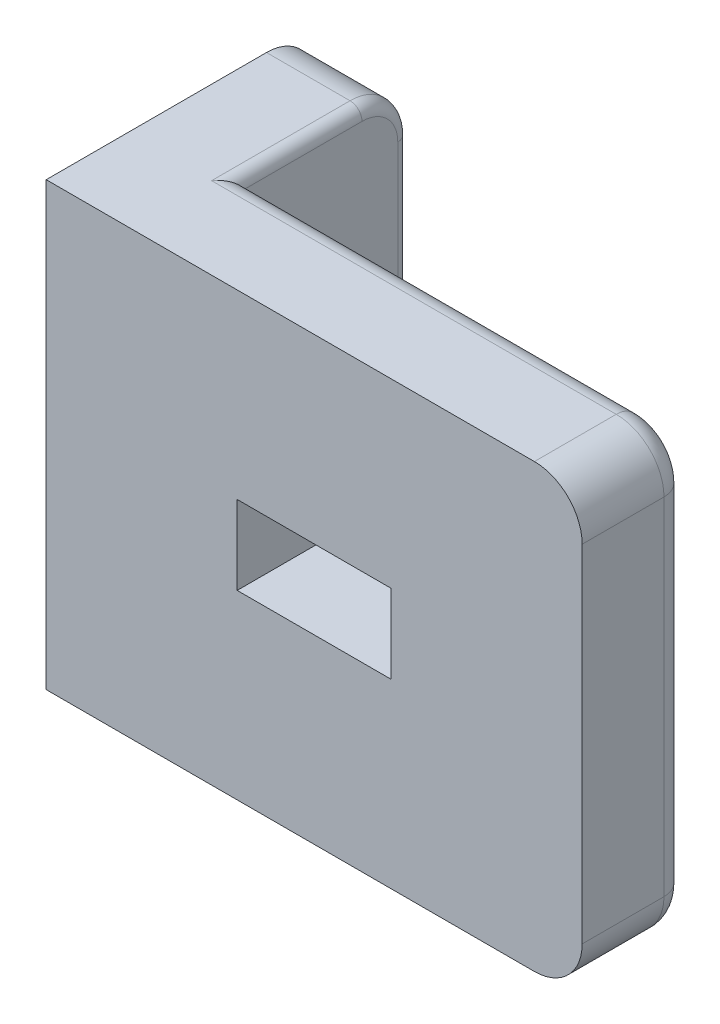
ISO-10303-21;
HEADER;
FILE_DESCRIPTION(('STEP AP214'),'2;1');
FILE_NAME('part.step','',(''),(''),'','','');
FILE_SCHEMA(('AUTOMOTIVE_DESIGN { 1 0 10303 214 1 1 1 1 }'));
ENDSEC;
DATA;
#1=APPLICATION_CONTEXT('core data for automotive mechanical design processes');
#2=APPLICATION_PROTOCOL_DEFINITION('international standard','automotive_design',2000,#1);
#3=PRODUCT_CONTEXT('',#1,'mechanical');
#4=PRODUCT('Part','Part','',(#3));
#5=PRODUCT_RELATED_PRODUCT_CATEGORY('part','',(#4));
#6=PRODUCT_DEFINITION_FORMATION('','',#4);
#7=PRODUCT_DEFINITION_CONTEXT('part definition',#1,'design');
#8=PRODUCT_DEFINITION('design','',#6,#7);
#9=PRODUCT_DEFINITION_SHAPE('','',#8);
#10=(LENGTH_UNIT() NAMED_UNIT(*) SI_UNIT(.MILLI.,.METRE.));
#11=(NAMED_UNIT(*) PLANE_ANGLE_UNIT() SI_UNIT($,.RADIAN.));
#12=(NAMED_UNIT(*) SI_UNIT($,.STERADIAN.) SOLID_ANGLE_UNIT());
#13=UNCERTAINTY_MEASURE_WITH_UNIT(LENGTH_MEASURE(1.E-05),#10,'distance_accuracy_value','');
#14=(GEOMETRIC_REPRESENTATION_CONTEXT(3) GLOBAL_UNCERTAINTY_ASSIGNED_CONTEXT((#13)) GLOBAL_UNIT_ASSIGNED_CONTEXT((#10,
#11,#12)) REPRESENTATION_CONTEXT('',''));
#15=CARTESIAN_POINT('',(0.,0.,0.));
#16=DIRECTION('',(0.,0.,1.));
#17=DIRECTION('',(1.,0.,0.));
#18=AXIS2_PLACEMENT_3D('',#15,#16,#17);
#19=CARTESIAN_POINT('',(22.45,18.5,0.));
#20=DIRECTION('',(0.,0.,-1.));
#21=DIRECTION('',(-1.,0.,0.));
#22=AXIS2_PLACEMENT_3D('',#19,#20,#21);
#23=PLANE('',#22);
#24=DIRECTION('',(-1.,0.,0.));
#25=VECTOR('',#24,1.);
#26=CARTESIAN_POINT('',(8.,10.9,0.));
#27=LINE('',#26,#25);
#28=CARTESIAN_POINT('',(14.45,10.9,0.));
#29=VERTEX_POINT('',#28);
#30=CARTESIAN_POINT('',(8.,10.9,0.));
#31=VERTEX_POINT('',#30);
#32=EDGE_CURVE('E202',#29,#31,#27,.T.);
#33=ORIENTED_EDGE('',*,*,#32,.F.);
#34=DIRECTION('',(0.,1.,0.));
#35=VECTOR('',#34,1.);
#36=CARTESIAN_POINT('',(14.45,10.9,0.));
#37=LINE('',#36,#35);
#38=CARTESIAN_POINT('',(14.45,7.6,0.));
#39=VERTEX_POINT('',#38);
#40=EDGE_CURVE('E208',#39,#29,#37,.T.);
#41=ORIENTED_EDGE('',*,*,#40,.F.);
#42=DIRECTION('',(1.,0.,0.));
#43=VECTOR('',#42,1.);
#44=CARTESIAN_POINT('',(14.45,7.6,0.));
#45=LINE('',#44,#43);
#46=CARTESIAN_POINT('',(8.,7.6,0.));
#47=VERTEX_POINT('',#46);
#48=EDGE_CURVE('E212',#47,#39,#45,.T.);
#49=ORIENTED_EDGE('',*,*,#48,.F.);
#50=DIRECTION('',(0.,-1.,0.));
#51=VECTOR('',#50,1.);
#52=CARTESIAN_POINT('',(8.,7.6,0.));
#53=LINE('',#52,#51);
#54=EDGE_CURVE('E192',#31,#47,#53,.T.);
#55=ORIENTED_EDGE('',*,*,#54,.F.);
#56=EDGE_LOOP('',(#33,#41,#49,#55));
#57=FACE_BOUND('',#56,.T.);
#58=DIRECTION('',(0.,-1.,0.));
#59=VECTOR('',#58,1.);
#60=CARTESIAN_POINT('',(22.45,18.5,0.));
#61=LINE('',#60,#59);
#62=CARTESIAN_POINT('',(22.45,16.5,0.));
#63=VERTEX_POINT('',#62);
#64=CARTESIAN_POINT('',(22.45,2.,0.));
#65=VERTEX_POINT('',#64);
#66=EDGE_CURVE('E240',#63,#65,#61,.T.);
#67=ORIENTED_EDGE('',*,*,#66,.F.);
#68=CARTESIAN_POINT('',(20.45,16.5,0.));
#69=DIRECTION('',(0.,0.,-1.));
#70=DIRECTION('',(-1.,0.,0.));
#71=AXIS2_PLACEMENT_3D('',#68,#69,#70);
#72=CIRCLE('',#71,2.);
#73=CARTESIAN_POINT('',(20.45,18.5,0.));
#74=VERTEX_POINT('',#73);
#75=EDGE_CURVE('E268',#63,#74,#72,.F.);
#76=ORIENTED_EDGE('',*,*,#75,.T.);
#77=DIRECTION('',(1.,0.,0.));
#78=VECTOR('',#77,1.);
#79=CARTESIAN_POINT('',(22.45,18.5,0.));
#80=LINE('',#79,#78);
#81=CARTESIAN_POINT('',(0.,18.5,0.));
#82=VERTEX_POINT('',#81);
#83=EDGE_CURVE('E222',#82,#74,#80,.T.);
#84=ORIENTED_EDGE('',*,*,#83,.F.);
#85=DIRECTION('',(0.,-1.,0.));
#86=VECTOR('',#85,1.);
#87=CARTESIAN_POINT('',(0.,18.5,0.));
#88=LINE('',#87,#86);
#89=CARTESIAN_POINT('',(0.,0.,0.));
#90=VERTEX_POINT('',#89);
#91=EDGE_CURVE('E228',#82,#90,#88,.T.);
#92=ORIENTED_EDGE('',*,*,#91,.T.);
#93=DIRECTION('',(1.,0.,0.));
#94=VECTOR('',#93,1.);
#95=CARTESIAN_POINT('',(22.45,0.,0.));
#96=LINE('',#95,#94);
#97=CARTESIAN_POINT('',(20.45,0.,0.));
#98=VERTEX_POINT('',#97);
#99=EDGE_CURVE('E219',#90,#98,#96,.T.);
#100=ORIENTED_EDGE('',*,*,#99,.T.);
#101=CARTESIAN_POINT('',(20.45,2.,0.));
#102=DIRECTION('',(0.,0.,-1.));
#103=DIRECTION('',(-1.,0.,0.));
#104=AXIS2_PLACEMENT_3D('',#101,#102,#103);
#105=CIRCLE('',#104,2.);
#106=EDGE_CURVE('E261',#98,#65,#105,.F.);
#107=ORIENTED_EDGE('',*,*,#106,.T.);
#108=EDGE_LOOP('',(#67,#76,#84,#92,#100,#107));
#109=FACE_BOUND('',#108,.T.);
#110=ADVANCED_FACE('F36',(#57,#109),#23,.F.);
#111=CARTESIAN_POINT('',(22.45,18.5,-4.42723965083429));
#112=DIRECTION('',(-1.,0.,0.));
#113=DIRECTION('',(0.,0.,1.));
#114=AXIS2_PLACEMENT_3D('',#111,#112,#113);
#115=PLANE('',#114);
#116=DIRECTION('',(0.,0.,-1.));
#117=VECTOR('',#116,1.);
#118=CARTESIAN_POINT('',(22.45,2.,-4.42723965083429));
#119=LINE('',#118,#117);
#120=CARTESIAN_POINT('',(22.45,2.,-3.42723965083429));
#121=VERTEX_POINT('',#120);
#122=EDGE_CURVE('E256',#65,#121,#119,.T.);
#123=ORIENTED_EDGE('',*,*,#122,.T.);
#124=DIRECTION('',(0.,-1.,0.));
#125=VECTOR('',#124,1.);
#126=CARTESIAN_POINT('',(22.45,18.5,-3.42723965083429));
#127=LINE('',#126,#125);
#128=CARTESIAN_POINT('',(22.45,16.5,-3.42723965083429));
#129=VERTEX_POINT('',#128);
#130=EDGE_CURVE('E324',#121,#129,#127,.F.);
#131=ORIENTED_EDGE('',*,*,#130,.T.);
#132=DIRECTION('',(0.,0.,-1.));
#133=VECTOR('',#132,1.);
#134=CARTESIAN_POINT('',(22.45,16.5,-4.42723965083429));
#135=LINE('',#134,#133);
#136=EDGE_CURVE('E266',#129,#63,#135,.F.);
#137=ORIENTED_EDGE('',*,*,#136,.T.);
#138=ORIENTED_EDGE('',*,*,#66,.T.);
#139=EDGE_LOOP('',(#123,#131,#137,#138));
#140=FACE_BOUND('',#139,.T.);
#141=ADVANCED_FACE('F402',(#140),#115,.F.);
#142=CARTESIAN_POINT('',(4.,18.5,-4.42723965083428));
#143=DIRECTION('',(0.,0.,1.));
#144=DIRECTION('',(1.,0.,0.));
#145=AXIS2_PLACEMENT_3D('',#142,#143,#144);
#146=PLANE('',#145);
#147=DIRECTION('',(1.,0.,0.));
#148=VECTOR('',#147,1.);
#149=CARTESIAN_POINT('',(3.99999999999999,6.6,-4.42723965083428));
#150=LINE('',#149,#148);
#151=CARTESIAN_POINT('',(7.,6.6,-4.42723965083428));
#152=VERTEX_POINT('',#151);
#153=CARTESIAN_POINT('',(15.45,6.6,-4.42723965083429));
#154=VERTEX_POINT('',#153);
#155=EDGE_CURVE('E274',#152,#154,#150,.T.);
#156=ORIENTED_EDGE('',*,*,#155,.T.);
#157=DIRECTION('',(0.,1.,0.));
#158=VECTOR('',#157,1.);
#159=CARTESIAN_POINT('',(15.45,18.5,-4.42723965083429));
#160=LINE('',#159,#158);
#161=CARTESIAN_POINT('',(15.45,11.9,-4.42723965083429));
#162=VERTEX_POINT('',#161);
#163=EDGE_CURVE('E276',#154,#162,#160,.T.);
#164=ORIENTED_EDGE('',*,*,#163,.T.);
#165=DIRECTION('',(-1.,0.,0.));
#166=VECTOR('',#165,1.);
#167=CARTESIAN_POINT('',(4.,11.9,-4.42723965083428));
#168=LINE('',#167,#166);
#169=CARTESIAN_POINT('',(7.,11.9,-4.42723965083428));
#170=VERTEX_POINT('',#169);
#171=EDGE_CURVE('E270',#162,#170,#168,.T.);
#172=ORIENTED_EDGE('',*,*,#171,.T.);
#173=DIRECTION('',(0.,-1.,0.));
#174=VECTOR('',#173,1.);
#175=CARTESIAN_POINT('',(7.,18.5,-4.42723965083428));
#176=LINE('',#175,#174);
#177=EDGE_CURVE('E272',#170,#152,#176,.T.);
#178=ORIENTED_EDGE('',*,*,#177,.T.);
#179=EDGE_LOOP('',(#156,#164,#172,#178));
#180=FACE_BOUND('',#179,.T.);
#181=DIRECTION('',(0.,-1.,0.));
#182=VECTOR('',#181,1.);
#183=CARTESIAN_POINT('',(4.,18.5,-4.42723965083428));
#184=LINE('',#183,#182);
#185=CARTESIAN_POINT('',(4.,17.5,-4.42723965083428));
#186=VERTEX_POINT('',#185);
#187=CARTESIAN_POINT('',(4.,1.,-4.42723965083428));
#188=VERTEX_POINT('',#187);
#189=EDGE_CURVE('E237',#186,#188,#184,.T.);
#190=ORIENTED_EDGE('',*,*,#189,.F.);
#191=DIRECTION('',(-1.,0.,0.));
#192=VECTOR('',#191,1.);
#193=CARTESIAN_POINT('',(4.,17.5,-4.42723965083428));
#194=LINE('',#193,#192);
#195=CARTESIAN_POINT('',(20.45,17.5,-4.42723965083429));
#196=VERTEX_POINT('',#195);
#197=EDGE_CURVE('E320',#186,#196,#194,.F.);
#198=ORIENTED_EDGE('',*,*,#197,.T.);
#199=CARTESIAN_POINT('',(20.45,16.5,-4.42723965083429));
#200=DIRECTION('',(0.,0.,1.));
#201=DIRECTION('',(1.,0.,0.));
#202=AXIS2_PLACEMENT_3D('',#199,#200,#201);
#203=CIRCLE('',#202,1.);
#204=CARTESIAN_POINT('',(21.45,16.5,-4.42723965083429));
#205=VERTEX_POINT('',#204);
#206=EDGE_CURVE('E318',#196,#205,#203,.F.);
#207=ORIENTED_EDGE('',*,*,#206,.T.);
#208=DIRECTION('',(0.,-1.,0.));
#209=VECTOR('',#208,1.);
#210=CARTESIAN_POINT('',(21.45,18.5,-4.42723965083429));
#211=LINE('',#210,#209);
#212=CARTESIAN_POINT('',(21.45,2.,-4.42723965083429));
#213=VERTEX_POINT('',#212);
#214=EDGE_CURVE('E316',#205,#213,#211,.T.);
#215=ORIENTED_EDGE('',*,*,#214,.T.);
#216=CARTESIAN_POINT('',(20.45,2.,-4.42723965083429));
#217=DIRECTION('',(0.,0.,1.));
#218=DIRECTION('',(1.,0.,0.));
#219=AXIS2_PLACEMENT_3D('',#216,#217,#218);
#220=CIRCLE('',#219,1.);
#221=CARTESIAN_POINT('',(20.45,1.,-4.42723965083429));
#222=VERTEX_POINT('',#221);
#223=EDGE_CURVE('E314',#213,#222,#220,.F.);
#224=ORIENTED_EDGE('',*,*,#223,.T.);
#225=DIRECTION('',(-1.,0.,0.));
#226=VECTOR('',#225,1.);
#227=CARTESIAN_POINT('',(4.,1.,-4.42723965083428));
#228=LINE('',#227,#226);
#229=EDGE_CURVE('E312',#222,#188,#228,.T.);
#230=ORIENTED_EDGE('',*,*,#229,.T.);
#231=EDGE_LOOP('',(#190,#198,#207,#215,#224,#230));
#232=FACE_BOUND('',#231,.T.);
#233=ADVANCED_FACE('F407',(#180,#232),#146,.F.);
#234=CARTESIAN_POINT('',(4.,18.5,-11.2272396508343));
#235=DIRECTION('',(-1.,0.,0.));
#236=DIRECTION('',(0.,0.,1.));
#237=AXIS2_PLACEMENT_3D('',#234,#235,#236);
#238=PLANE('',#237);
#239=CARTESIAN_POINT('',(4.,9.25,-7.82723965083428));
#240=DIRECTION('',(-1.,0.,0.));
#241=DIRECTION('',(0.,0.,1.));
#242=AXIS2_PLACEMENT_3D('',#239,#240,#241);
#243=CIRCLE('',#242,2.75);
#244=CARTESIAN_POINT('',(4.,9.25,-5.07723965083428));
#245=VERTEX_POINT('',#244);
#246=EDGE_CURVE('E302',#245,#245,#243,.T.);
#247=ORIENTED_EDGE('',*,*,#246,.T.);
#248=EDGE_LOOP('',(#247));
#249=FACE_BOUND('',#248,.T.);
#250=CARTESIAN_POINT('',(4.,1.,-3.42723965083428));
#251=DIRECTION('',(-1.,0.,0.));
#252=DIRECTION('',(0.,0.,1.));
#253=AXIS2_PLACEMENT_3D('',#250,#251,#252);
#254=CIRCLE('',#253,1.);
#255=CARTESIAN_POINT('',(4.,0.5,-4.29326505461872));
#256=VERTEX_POINT('',#255);
#257=EDGE_CURVE('E332',#188,#256,#254,.T.);
#258=ORIENTED_EDGE('',*,*,#257,.T.);
#259=DIRECTION('',(0.,0.,-1.));
#260=VECTOR('',#259,1.);
#261=CARTESIAN_POINT('',(4.,0.5,-9.22723965083428));
#262=LINE('',#261,#260);
#263=CARTESIAN_POINT('',(4.,0.499999999999998,-9.22723965083428));
#264=VERTEX_POINT('',#263);
#265=EDGE_CURVE('E354',#256,#264,#262,.T.);
#266=ORIENTED_EDGE('',*,*,#265,.T.);
#267=CARTESIAN_POINT('',(4.,2.,-9.22723965083428));
#268=DIRECTION('',(-1.,0.,0.));
#269=DIRECTION('',(0.,0.,1.));
#270=AXIS2_PLACEMENT_3D('',#267,#268,#269);
#271=CIRCLE('',#270,1.5);
#272=CARTESIAN_POINT('',(4.,2.,-10.7272396508343));
#273=VERTEX_POINT('',#272);
#274=EDGE_CURVE('E352',#264,#273,#271,.F.);
#275=ORIENTED_EDGE('',*,*,#274,.T.);
#276=DIRECTION('',(0.,-1.,0.));
#277=VECTOR('',#276,1.);
#278=CARTESIAN_POINT('',(4.,18.5,-10.7272396508343));
#279=LINE('',#278,#277);
#280=CARTESIAN_POINT('',(4.,16.5,-10.7272396508343));
#281=VERTEX_POINT('',#280);
#282=EDGE_CURVE('E350',#273,#281,#279,.F.);
#283=ORIENTED_EDGE('',*,*,#282,.T.);
#284=CARTESIAN_POINT('',(4.,16.5,-9.22723965083428));
#285=DIRECTION('',(-1.,0.,0.));
#286=DIRECTION('',(0.,0.,1.));
#287=AXIS2_PLACEMENT_3D('',#284,#285,#286);
#288=CIRCLE('',#287,1.5);
#289=CARTESIAN_POINT('',(4.,18.,-9.22723965083428));
#290=VERTEX_POINT('',#289);
#291=EDGE_CURVE('E348',#281,#290,#288,.F.);
#292=ORIENTED_EDGE('',*,*,#291,.T.);
#293=DIRECTION('',(0.,0.,-1.));
#294=VECTOR('',#293,1.);
#295=CARTESIAN_POINT('',(4.,18.,-11.2272396508343));
#296=LINE('',#295,#294);
#297=CARTESIAN_POINT('',(4.,18.,-4.29326505461872));
#298=VERTEX_POINT('',#297);
#299=EDGE_CURVE('E335',#290,#298,#296,.F.);
#300=ORIENTED_EDGE('',*,*,#299,.T.);
#301=CARTESIAN_POINT('',(4.,17.5,-3.42723965083428));
#302=DIRECTION('',(-1.,0.,0.));
#303=DIRECTION('',(0.,0.,1.));
#304=AXIS2_PLACEMENT_3D('',#301,#302,#303);
#305=CIRCLE('',#304,1.);
#306=EDGE_CURVE('E330',#298,#186,#305,.T.);
#307=ORIENTED_EDGE('',*,*,#306,.T.);
#308=ORIENTED_EDGE('',*,*,#189,.T.);
#309=EDGE_LOOP('',(#258,#266,#275,#283,#292,#300,#307,#308));
#310=FACE_BOUND('',#309,.T.);
#311=ADVANCED_FACE('F480',(#249,#310),#238,.F.);
#312=CARTESIAN_POINT('',(0.,18.5,-11.2272396508343));
#313=DIRECTION('',(0.,0.,1.));
#314=DIRECTION('',(1.,0.,0.));
#315=AXIS2_PLACEMENT_3D('',#312,#313,#314);
#316=PLANE('',#315);
#317=DIRECTION('',(-1.,0.,0.));
#318=VECTOR('',#317,1.);
#319=CARTESIAN_POINT('',(0.,16.5,-11.2272396508343));
#320=LINE('',#319,#318);
#321=CARTESIAN_POINT('',(0.,16.5,-11.2272396508343));
#322=VERTEX_POINT('',#321);
#323=CARTESIAN_POINT('',(3.5,16.5,-11.2272396508343));
#324=VERTEX_POINT('',#323);
#325=EDGE_CURVE('E246',#322,#324,#320,.F.);
#326=ORIENTED_EDGE('',*,*,#325,.T.);
#327=DIRECTION('',(0.,-1.,0.));
#328=VECTOR('',#327,1.);
#329=CARTESIAN_POINT('',(3.5,18.5,-11.2272396508343));
#330=LINE('',#329,#328);
#331=CARTESIAN_POINT('',(3.5,2.,-11.2272396508343));
#332=VERTEX_POINT('',#331);
#333=EDGE_CURVE('E362',#324,#332,#330,.T.);
#334=ORIENTED_EDGE('',*,*,#333,.T.);
#335=DIRECTION('',(-1.,0.,0.));
#336=VECTOR('',#335,1.);
#337=CARTESIAN_POINT('',(0.,2.,-11.2272396508343));
#338=LINE('',#337,#336);
#339=CARTESIAN_POINT('',(0.,2.,-11.2272396508343));
#340=VERTEX_POINT('',#339);
#341=EDGE_CURVE('E249',#332,#340,#338,.T.);
#342=ORIENTED_EDGE('',*,*,#341,.T.);
#343=DIRECTION('',(0.,-1.,0.));
#344=VECTOR('',#343,1.);
#345=CARTESIAN_POINT('',(0.,18.5,-11.2272396508343));
#346=LINE('',#345,#344);
#347=EDGE_CURVE('E234',#322,#340,#346,.T.);
#348=ORIENTED_EDGE('',*,*,#347,.F.);
#349=EDGE_LOOP('',(#326,#334,#342,#348));
#350=FACE_BOUND('',#349,.T.);
#351=ADVANCED_FACE('F496',(#350),#316,.F.);
#352=CARTESIAN_POINT('',(0.,18.5,0.));
#353=DIRECTION('',(1.,0.,0.));
#354=DIRECTION('',(0.,0.,-1.));
#355=AXIS2_PLACEMENT_3D('',#352,#353,#354);
#356=PLANE('',#355);
#357=CARTESIAN_POINT('',(0.,9.25,-7.82723965083428));
#358=DIRECTION('',(1.,0.,0.));
#359=DIRECTION('',(0.,0.,-1.));
#360=AXIS2_PLACEMENT_3D('',#357,#358,#359);
#361=CIRCLE('',#360,1.15);
#362=CARTESIAN_POINT('',(0.,9.25,-8.97723965083428));
#363=VERTEX_POINT('',#362);
#364=EDGE_CURVE('E568',#363,#363,#361,.T.);
#365=ORIENTED_EDGE('',*,*,#364,.T.);
#366=EDGE_LOOP('',(#365));
#367=FACE_BOUND('',#366,.T.);
#368=ORIENTED_EDGE('',*,*,#347,.T.);
#369=CARTESIAN_POINT('',(0.,2.,-9.22723965083428));
#370=DIRECTION('',(1.,0.,0.));
#371=DIRECTION('',(0.,0.,-1.));
#372=AXIS2_PLACEMENT_3D('',#369,#370,#371);
#373=CIRCLE('',#372,2.);
#374=CARTESIAN_POINT('',(0.,0.,-9.22723965083428));
#375=VERTEX_POINT('',#374);
#376=EDGE_CURVE('E251',#340,#375,#373,.F.);
#377=ORIENTED_EDGE('',*,*,#376,.T.);
#378=DIRECTION('',(0.,0.,1.));
#379=VECTOR('',#378,1.);
#380=CARTESIAN_POINT('',(0.,0.,0.));
#381=LINE('',#380,#379);
#382=EDGE_CURVE('E226',#375,#90,#381,.T.);
#383=ORIENTED_EDGE('',*,*,#382,.T.);
#384=ORIENTED_EDGE('',*,*,#91,.F.);
#385=DIRECTION('',(0.,0.,1.));
#386=VECTOR('',#385,1.);
#387=CARTESIAN_POINT('',(0.,18.5,0.));
#388=LINE('',#387,#386);
#389=CARTESIAN_POINT('',(0.,18.5,-9.22723965083428));
#390=VERTEX_POINT('',#389);
#391=EDGE_CURVE('E225',#390,#82,#388,.T.);
#392=ORIENTED_EDGE('',*,*,#391,.F.);
#393=CARTESIAN_POINT('',(0.,16.5,-9.22723965083428));
#394=DIRECTION('',(1.,0.,0.));
#395=DIRECTION('',(0.,0.,-1.));
#396=AXIS2_PLACEMENT_3D('',#393,#394,#395);
#397=CIRCLE('',#396,2.);
#398=EDGE_CURVE('E244',#390,#322,#397,.F.);
#399=ORIENTED_EDGE('',*,*,#398,.T.);
#400=EDGE_LOOP('',(#368,#377,#383,#384,#392,#399));
#401=FACE_BOUND('',#400,.T.);
#402=ADVANCED_FACE('F500',(#367,#401),#356,.F.);
#403=CARTESIAN_POINT('',(0.,18.5,0.));
#404=DIRECTION('',(0.,-1.,0.));
#405=DIRECTION('',(0.,0.,-1.));
#406=AXIS2_PLACEMENT_3D('',#403,#404,#405);
#407=PLANE('',#406);
#408=DIRECTION('',(-1.,0.,0.));
#409=VECTOR('',#408,1.);
#410=CARTESIAN_POINT('',(0.,18.5,-3.42723965083428));
#411=LINE('',#410,#409);
#412=CARTESIAN_POINT('',(20.45,18.5,-3.42723965083429));
#413=VERTEX_POINT('',#412);
#414=CARTESIAN_POINT('',(3.5,18.5,-3.42723965083428));
#415=VERTEX_POINT('',#414);
#416=EDGE_CURVE('E54',#413,#415,#411,.T.);
#417=ORIENTED_EDGE('',*,*,#416,.T.);
#418=DIRECTION('',(0.,0.,-1.));
#419=VECTOR('',#418,1.);
#420=CARTESIAN_POINT('',(3.5,18.5,0.));
#421=LINE('',#420,#419);
#422=CARTESIAN_POINT('',(3.5,18.5,-9.22723965083428));
#423=VERTEX_POINT('',#422);
#424=EDGE_CURVE('E58',#415,#423,#421,.T.);
#425=ORIENTED_EDGE('',*,*,#424,.T.);
#426=DIRECTION('',(-1.,0.,0.));
#427=VECTOR('',#426,1.);
#428=CARTESIAN_POINT('',(0.,18.5,-9.22723965083428));
#429=LINE('',#428,#427);
#430=EDGE_CURVE('E242',#423,#390,#429,.T.);
#431=ORIENTED_EDGE('',*,*,#430,.T.);
#432=ORIENTED_EDGE('',*,*,#391,.T.);
#433=ORIENTED_EDGE('',*,*,#83,.T.);
#434=DIRECTION('',(0.,0.,-1.));
#435=VECTOR('',#434,1.);
#436=CARTESIAN_POINT('',(20.45,18.5,0.));
#437=LINE('',#436,#435);
#438=EDGE_CURVE('E264',#74,#413,#437,.T.);
#439=ORIENTED_EDGE('',*,*,#438,.T.);
#440=EDGE_LOOP('',(#417,#425,#431,#432,#433,#439));
#441=FACE_BOUND('',#440,.T.);
#442=ADVANCED_FACE('F505',(#441),#407,.F.);
#443=CARTESIAN_POINT('',(0.,0.,0.));
#444=DIRECTION('',(0.,-1.,0.));
#445=DIRECTION('',(0.,0.,-1.));
#446=AXIS2_PLACEMENT_3D('',#443,#444,#445);
#447=PLANE('',#446);
#448=DIRECTION('',(-1.,0.,0.));
#449=VECTOR('',#448,1.);
#450=CARTESIAN_POINT('',(4.,0.,-9.22723965083428));
#451=LINE('',#450,#449);
#452=CARTESIAN_POINT('',(3.5,0.,-9.22723965083428));
#453=VERTEX_POINT('',#452);
#454=EDGE_CURVE('E253',#375,#453,#451,.F.);
#455=ORIENTED_EDGE('',*,*,#454,.T.);
#456=DIRECTION('',(0.,0.,-1.));
#457=VECTOR('',#456,1.);
#458=CARTESIAN_POINT('',(3.5,0.,-3.42723965083428));
#459=LINE('',#458,#457);
#460=CARTESIAN_POINT('',(3.5,0.,-3.42723965083428));
#461=VERTEX_POINT('',#460);
#462=EDGE_CURVE('E357',#453,#461,#459,.F.);
#463=ORIENTED_EDGE('',*,*,#462,.T.);
#464=DIRECTION('',(-1.,0.,0.));
#465=VECTOR('',#464,1.);
#466=CARTESIAN_POINT('',(20.45,0.,-3.42723965083429));
#467=LINE('',#466,#465);
#468=CARTESIAN_POINT('',(20.45,0.,-3.42723965083429));
#469=VERTEX_POINT('',#468);
#470=EDGE_CURVE('E328',#461,#469,#467,.F.);
#471=ORIENTED_EDGE('',*,*,#470,.T.);
#472=DIRECTION('',(0.,0.,-1.));
#473=VECTOR('',#472,1.);
#474=CARTESIAN_POINT('',(20.45,0.,0.));
#475=LINE('',#474,#473);
#476=EDGE_CURVE('E259',#469,#98,#475,.F.);
#477=ORIENTED_EDGE('',*,*,#476,.T.);
#478=ORIENTED_EDGE('',*,*,#99,.F.);
#479=ORIENTED_EDGE('',*,*,#382,.F.);
#480=EDGE_LOOP('',(#455,#463,#471,#477,#478,#479));
#481=FACE_BOUND('',#480,.T.);
#482=ADVANCED_FACE('F521',(#481),#447,.T.);
#483=CARTESIAN_POINT('',(14.45,10.9,-4.49999999999999));
#484=DIRECTION('',(1.,0.,0.));
#485=DIRECTION('',(0.,1.,0.));
#486=AXIS2_PLACEMENT_3D('',#483,#484,#485);
#487=PLANE('',#486);
#488=DIRECTION('',(0.,0.,1.));
#489=VECTOR('',#488,1.);
#490=CARTESIAN_POINT('',(14.45,10.9,-4.49999999999999));
#491=LINE('',#490,#489);
#492=CARTESIAN_POINT('',(14.45,10.9,-3.42723965083429));
#493=VERTEX_POINT('',#492);
#494=EDGE_CURVE('E199',#493,#29,#491,.T.);
#495=ORIENTED_EDGE('',*,*,#494,.F.);
#496=DIRECTION('',(0.,1.,0.));
#497=VECTOR('',#496,1.);
#498=CARTESIAN_POINT('',(14.45,10.9,-3.42723965083429));
#499=LINE('',#498,#497);
#500=CARTESIAN_POINT('',(14.45,7.6,-3.42723965083429));
#501=VERTEX_POINT('',#500);
#502=EDGE_CURVE('E279',#493,#501,#499,.F.);
#503=ORIENTED_EDGE('',*,*,#502,.T.);
#504=DIRECTION('',(0.,0.,1.));
#505=VECTOR('',#504,1.);
#506=CARTESIAN_POINT('',(14.45,7.6,-4.49999999999999));
#507=LINE('',#506,#505);
#508=EDGE_CURVE('E217',#501,#39,#507,.T.);
#509=ORIENTED_EDGE('',*,*,#508,.T.);
#510=ORIENTED_EDGE('',*,*,#40,.T.);
#511=EDGE_LOOP('',(#495,#503,#509,#510));
#512=FACE_BOUND('',#511,.T.);
#513=ADVANCED_FACE('F535',(#512),#487,.F.);
#514=CARTESIAN_POINT('',(14.45,7.6,-4.49999999999999));
#515=DIRECTION('',(0.,-1.,0.));
#516=DIRECTION('',(1.,0.,0.));
#517=AXIS2_PLACEMENT_3D('',#514,#515,#516);
#518=PLANE('',#517);
#519=ORIENTED_EDGE('',*,*,#508,.F.);
#520=DIRECTION('',(1.,0.,0.));
#521=VECTOR('',#520,1.);
#522=CARTESIAN_POINT('',(14.45,7.6,-3.42723965083429));
#523=LINE('',#522,#521);
#524=CARTESIAN_POINT('',(8.,7.6,-3.42723965083428));
#525=VERTEX_POINT('',#524);
#526=EDGE_CURVE('E282',#501,#525,#523,.F.);
#527=ORIENTED_EDGE('',*,*,#526,.T.);
#528=DIRECTION('',(0.,0.,1.));
#529=VECTOR('',#528,1.);
#530=CARTESIAN_POINT('',(8.,7.6,-4.49999999999999));
#531=LINE('',#530,#529);
#532=EDGE_CURVE('E198',#525,#47,#531,.T.);
#533=ORIENTED_EDGE('',*,*,#532,.T.);
#534=ORIENTED_EDGE('',*,*,#48,.T.);
#535=EDGE_LOOP('',(#519,#527,#533,#534));
#536=FACE_BOUND('',#535,.T.);
#537=ADVANCED_FACE('F541',(#536),#518,.F.);
#538=CARTESIAN_POINT('',(8.,7.6,-4.49999999999999));
#539=DIRECTION('',(-1.,0.,0.));
#540=DIRECTION('',(0.,0.,1.));
#541=AXIS2_PLACEMENT_3D('',#538,#539,#540);
#542=PLANE('',#541);
#543=ORIENTED_EDGE('',*,*,#532,.F.);
#544=DIRECTION('',(0.,-1.,0.));
#545=VECTOR('',#544,1.);
#546=CARTESIAN_POINT('',(8.,7.6,-3.42723965083428));
#547=LINE('',#546,#545);
#548=CARTESIAN_POINT('',(8.,10.9,-3.42723965083428));
#549=VERTEX_POINT('',#548);
#550=EDGE_CURVE('E195',#525,#549,#547,.F.);
#551=ORIENTED_EDGE('',*,*,#550,.T.);
#552=DIRECTION('',(0.,0.,1.));
#553=VECTOR('',#552,1.);
#554=CARTESIAN_POINT('',(8.,10.9,-4.49999999999999));
#555=LINE('',#554,#553);
#556=EDGE_CURVE('E187',#549,#31,#555,.T.);
#557=ORIENTED_EDGE('',*,*,#556,.T.);
#558=ORIENTED_EDGE('',*,*,#54,.T.);
#559=EDGE_LOOP('',(#543,#551,#557,#558));
#560=FACE_BOUND('',#559,.T.);
#561=ADVANCED_FACE('F190',(#560),#542,.F.);
#562=CARTESIAN_POINT('',(8.,10.9,-4.49999999999999));
#563=DIRECTION('',(0.,1.,0.));
#564=DIRECTION('',(0.,0.,1.));
#565=AXIS2_PLACEMENT_3D('',#562,#563,#564);
#566=PLANE('',#565);
#567=ORIENTED_EDGE('',*,*,#556,.F.);
#568=DIRECTION('',(-1.,0.,0.));
#569=VECTOR('',#568,1.);
#570=CARTESIAN_POINT('',(8.,10.9,-3.42723965083428));
#571=LINE('',#570,#569);
#572=EDGE_CURVE('E285',#549,#493,#571,.F.);
#573=ORIENTED_EDGE('',*,*,#572,.T.);
#574=ORIENTED_EDGE('',*,*,#494,.T.);
#575=ORIENTED_EDGE('',*,*,#32,.T.);
#576=EDGE_LOOP('',(#567,#573,#574,#575));
#577=FACE_BOUND('',#576,.T.);
#578=ADVANCED_FACE('F203',(#577),#566,.F.);
#579=CARTESIAN_POINT('',(2.25,9.25,-7.82723965083428));
#580=DIRECTION('',(1.,0.,0.));
#581=DIRECTION('',(0.,0.,-1.));
#582=AXIS2_PLACEMENT_3D('',#579,#580,#581);
#583=CYLINDRICAL_SURFACE('',#582,2.25);
#584=CARTESIAN_POINT('',(3.25,9.25,-7.82723965083428));
#585=DIRECTION('',(1.,0.,0.));
#586=DIRECTION('',(0.,0.,-1.));
#587=AXIS2_PLACEMENT_3D('',#584,#585,#586);
#588=CIRCLE('',#587,2.25);
#589=CARTESIAN_POINT('',(3.25,9.25,-10.0772396508343));
#590=VERTEX_POINT('',#589);
#591=EDGE_CURVE('E308',#590,#590,#588,.F.);
#592=ORIENTED_EDGE('',*,*,#591,.T.);
#593=EDGE_LOOP('',(#592));
#594=FACE_BOUND('',#593,.T.);
#595=CARTESIAN_POINT('',(3.5,9.25,-7.82723965083428));
#596=DIRECTION('',(-1.,0.,0.));
#597=DIRECTION('',(0.,0.,1.));
#598=AXIS2_PLACEMENT_3D('',#595,#596,#597);
#599=CIRCLE('',#598,2.25);
#600=CARTESIAN_POINT('',(3.5,9.25,-5.57723965083428));
#601=VERTEX_POINT('',#600);
#602=EDGE_CURVE('E287',#601,#601,#599,.F.);
#603=ORIENTED_EDGE('',*,*,#602,.T.);
#604=EDGE_LOOP('',(#603));
#605=FACE_BOUND('',#604,.T.);
#606=ADVANCED_FACE('F579',(#594,#605),#583,.F.);
#607=CARTESIAN_POINT('',(2.25,9.25,-7.82723965083428));
#608=DIRECTION('',(1.,0.,0.));
#609=DIRECTION('',(0.,0.,-1.));
#610=AXIS2_PLACEMENT_3D('',#607,#608,#609);
#611=PLANE('',#610);
#612=CARTESIAN_POINT('',(2.25,9.25,-7.82723965083428));
#613=DIRECTION('',(1.,0.,0.));
#614=DIRECTION('',(0.,0.,-1.));
#615=AXIS2_PLACEMENT_3D('',#612,#613,#614);
#616=CIRCLE('',#615,1.25);
#617=CARTESIAN_POINT('',(2.25,9.25,-9.07723965083428));
#618=VERTEX_POINT('',#617);
#619=EDGE_CURVE('E305',#618,#618,#616,.T.);
#620=ORIENTED_EDGE('',*,*,#619,.T.);
#621=EDGE_LOOP('',(#620));
#622=FACE_BOUND('',#621,.T.);
#623=CARTESIAN_POINT('',(2.25,9.25,-7.82723965083428));
#624=DIRECTION('',(1.,0.,0.));
#625=DIRECTION('',(0.,0.,-1.));
#626=AXIS2_PLACEMENT_3D('',#623,#624,#625);
#627=CIRCLE('',#626,1.15);
#628=CARTESIAN_POINT('',(2.25,9.25,-8.97723965083428));
#629=VERTEX_POINT('',#628);
#630=EDGE_CURVE('E299',#629,#629,#627,.T.);
#631=ORIENTED_EDGE('',*,*,#630,.F.);
#632=EDGE_LOOP('',(#631));
#633=FACE_BOUND('',#632,.T.);
#634=ADVANCED_FACE('F577',(#622,#633),#611,.T.);
#635=CARTESIAN_POINT('',(-0.0500000000000014,9.25,-7.82723965083428));
#636=DIRECTION('',(1.,0.,0.));
#637=DIRECTION('',(0.,0.,-1.));
#638=AXIS2_PLACEMENT_3D('',#635,#636,#637);
#639=CYLINDRICAL_SURFACE('',#638,1.15);
#640=ORIENTED_EDGE('',*,*,#630,.T.);
#641=EDGE_LOOP('',(#640));
#642=FACE_BOUND('',#641,.T.);
#643=ORIENTED_EDGE('',*,*,#364,.F.);
#644=EDGE_LOOP('',(#643));
#645=FACE_BOUND('',#644,.T.);
#646=ADVANCED_FACE('F416',(#642,#645),#639,.F.);
#647=CARTESIAN_POINT('',(0.,16.5,-9.22723965083428));
#648=DIRECTION('',(-1.,0.,0.));
#649=DIRECTION('',(0.,0.,1.));
#650=AXIS2_PLACEMENT_3D('',#647,#648,#649);
#651=CYLINDRICAL_SURFACE('',#650,2.);
#652=ORIENTED_EDGE('',*,*,#430,.F.);
#653=CARTESIAN_POINT('',(3.5,16.5,-9.22723965083428));
#654=DIRECTION('',(-1.,0.,0.));
#655=DIRECTION('',(0.,0.,1.));
#656=AXIS2_PLACEMENT_3D('',#653,#654,#655);
#657=CIRCLE('',#656,2.);
#658=EDGE_CURVE('E364',#423,#324,#657,.T.);
#659=ORIENTED_EDGE('',*,*,#658,.T.);
#660=ORIENTED_EDGE('',*,*,#325,.F.);
#661=ORIENTED_EDGE('',*,*,#398,.F.);
#662=EDGE_LOOP('',(#652,#659,#660,#661));
#663=FACE_BOUND('',#662,.T.);
#664=ADVANCED_FACE('F412',(#663),#651,.T.);
#665=CARTESIAN_POINT('',(0.,2.,-9.22723965083428));
#666=DIRECTION('',(1.,0.,0.));
#667=DIRECTION('',(0.,0.,-1.));
#668=AXIS2_PLACEMENT_3D('',#665,#666,#667);
#669=CYLINDRICAL_SURFACE('',#668,2.);
#670=ORIENTED_EDGE('',*,*,#341,.F.);
#671=CARTESIAN_POINT('',(3.5,2.,-9.22723965083428));
#672=DIRECTION('',(-1.,0.,0.));
#673=DIRECTION('',(0.,0.,1.));
#674=AXIS2_PLACEMENT_3D('',#671,#672,#673);
#675=CIRCLE('',#674,2.);
#676=EDGE_CURVE('E360',#332,#453,#675,.T.);
#677=ORIENTED_EDGE('',*,*,#676,.T.);
#678=ORIENTED_EDGE('',*,*,#454,.F.);
#679=ORIENTED_EDGE('',*,*,#376,.F.);
#680=EDGE_LOOP('',(#670,#677,#678,#679));
#681=FACE_BOUND('',#680,.T.);
#682=ADVANCED_FACE('F415',(#681),#669,.T.);
#683=CARTESIAN_POINT('',(20.45,2.,-4.42723965083429));
#684=DIRECTION('',(0.,0.,1.));
#685=DIRECTION('',(1.,0.,0.));
#686=AXIS2_PLACEMENT_3D('',#683,#684,#685);
#687=CYLINDRICAL_SURFACE('',#686,2.);
#688=ORIENTED_EDGE('',*,*,#476,.F.);
#689=CARTESIAN_POINT('',(20.45,2.,-3.42723965083429));
#690=DIRECTION('',(0.,0.,1.));
#691=DIRECTION('',(1.,0.,0.));
#692=AXIS2_PLACEMENT_3D('',#689,#690,#691);
#693=CIRCLE('',#692,2.);
#694=EDGE_CURVE('E326',#469,#121,#693,.T.);
#695=ORIENTED_EDGE('',*,*,#694,.T.);
#696=ORIENTED_EDGE('',*,*,#122,.F.);
#697=ORIENTED_EDGE('',*,*,#106,.F.);
#698=EDGE_LOOP('',(#688,#695,#696,#697));
#699=FACE_BOUND('',#698,.T.);
#700=ADVANCED_FACE('F420',(#699),#687,.T.);
#701=CARTESIAN_POINT('',(20.45,16.5,0.));
#702=DIRECTION('',(0.,0.,-1.));
#703=DIRECTION('',(-1.,0.,0.));
#704=AXIS2_PLACEMENT_3D('',#701,#702,#703);
#705=CYLINDRICAL_SURFACE('',#704,2.);
#706=ORIENTED_EDGE('',*,*,#136,.F.);
#707=CARTESIAN_POINT('',(20.45,16.5,-3.42723965083429));
#708=DIRECTION('',(0.,0.,1.));
#709=DIRECTION('',(1.,0.,0.));
#710=AXIS2_PLACEMENT_3D('',#707,#708,#709);
#711=CIRCLE('',#710,2.);
#712=EDGE_CURVE('E322',#129,#413,#711,.T.);
#713=ORIENTED_EDGE('',*,*,#712,.T.);
#714=ORIENTED_EDGE('',*,*,#438,.F.);
#715=ORIENTED_EDGE('',*,*,#75,.F.);
#716=EDGE_LOOP('',(#706,#713,#714,#715));
#717=FACE_BOUND('',#716,.T.);
#718=ADVANCED_FACE('F424',(#717),#705,.T.);
#719=CARTESIAN_POINT('',(7.,18.5,-3.42723965083428));
#720=DIRECTION('',(0.,-1.,0.));
#721=DIRECTION('',(0.,0.,-1.));
#722=AXIS2_PLACEMENT_3D('',#719,#720,#721);
#723=CYLINDRICAL_SURFACE('',#722,1.);
#724=CARTESIAN_POINT('',(7.,11.9,-3.42723965083428));
#725=DIRECTION('',(-0.707106781186547,-0.707106781186547,0.));
#726=DIRECTION('',(0.707106781186547,-0.707106781186547,0.));
#727=AXIS2_PLACEMENT_3D('',#724,#725,#726);
#728=ELLIPSE('',#727,1.41421356237309,1.);
#729=EDGE_CURVE('E293',#549,#170,#728,.F.);
#730=ORIENTED_EDGE('',*,*,#729,.F.);
#731=ORIENTED_EDGE('',*,*,#550,.F.);
#732=CARTESIAN_POINT('',(7.,6.6,-3.42723965083428));
#733=DIRECTION('',(0.707106781186547,-0.707106781186548,0.));
#734=DIRECTION('',(0.707106781186548,0.707106781186547,0.));
#735=AXIS2_PLACEMENT_3D('',#732,#733,#734);
#736=ELLIPSE('',#735,1.41421356237309,1.);
#737=EDGE_CURVE('E296',#152,#525,#736,.T.);
#738=ORIENTED_EDGE('',*,*,#737,.F.);
#739=ORIENTED_EDGE('',*,*,#177,.F.);
#740=EDGE_LOOP('',(#730,#731,#738,#739));
#741=FACE_BOUND('',#740,.T.);
#742=ADVANCED_FACE('F428',(#741),#723,.T.);
#743=CARTESIAN_POINT('',(4.,6.6,-3.42723965083428));
#744=DIRECTION('',(1.,0.,0.));
#745=DIRECTION('',(0.,0.,-1.));
#746=AXIS2_PLACEMENT_3D('',#743,#744,#745);
#747=CYLINDRICAL_SURFACE('',#746,1.);
#748=ORIENTED_EDGE('',*,*,#737,.T.);
#749=ORIENTED_EDGE('',*,*,#526,.F.);
#750=CARTESIAN_POINT('',(15.45,6.6,-3.42723965083429));
#751=DIRECTION('',(0.707106781186547,0.707106781186548,0.));
#752=DIRECTION('',(-0.707106781186548,0.707106781186547,0.));
#753=AXIS2_PLACEMENT_3D('',#750,#751,#752);
#754=ELLIPSE('',#753,1.4142135623731,1.);
#755=EDGE_CURVE('E290',#154,#501,#754,.T.);
#756=ORIENTED_EDGE('',*,*,#755,.F.);
#757=ORIENTED_EDGE('',*,*,#155,.F.);
#758=EDGE_LOOP('',(#748,#749,#756,#757));
#759=FACE_BOUND('',#758,.T.);
#760=ADVANCED_FACE('F438',(#759),#747,.T.);
#761=CARTESIAN_POINT('',(4.,11.9,-3.42723965083428));
#762=DIRECTION('',(-1.,0.,0.));
#763=DIRECTION('',(0.,0.,1.));
#764=AXIS2_PLACEMENT_3D('',#761,#762,#763);
#765=CYLINDRICAL_SURFACE('',#764,1.);
#766=ORIENTED_EDGE('',*,*,#729,.T.);
#767=ORIENTED_EDGE('',*,*,#171,.F.);
#768=CARTESIAN_POINT('',(15.45,11.9,-3.42723965083429));
#769=DIRECTION('',(-0.707106781186548,0.707106781186547,0.));
#770=DIRECTION('',(0.707106781186547,0.707106781186548,0.));
#771=AXIS2_PLACEMENT_3D('',#768,#769,#770);
#772=ELLIPSE('',#771,1.41421356237309,1.);
#773=EDGE_CURVE('E288',#493,#162,#772,.F.);
#774=ORIENTED_EDGE('',*,*,#773,.F.);
#775=ORIENTED_EDGE('',*,*,#572,.F.);
#776=EDGE_LOOP('',(#766,#767,#774,#775));
#777=FACE_BOUND('',#776,.T.);
#778=ADVANCED_FACE('F434',(#777),#765,.T.);
#779=CARTESIAN_POINT('',(15.45,18.5,-3.42723965083429));
#780=DIRECTION('',(0.,1.,0.));
#781=DIRECTION('',(-1.,0.,0.));
#782=AXIS2_PLACEMENT_3D('',#779,#780,#781);
#783=CYLINDRICAL_SURFACE('',#782,1.);
#784=ORIENTED_EDGE('',*,*,#755,.T.);
#785=ORIENTED_EDGE('',*,*,#502,.F.);
#786=ORIENTED_EDGE('',*,*,#773,.T.);
#787=ORIENTED_EDGE('',*,*,#163,.F.);
#788=EDGE_LOOP('',(#784,#785,#786,#787));
#789=FACE_BOUND('',#788,.T.);
#790=ADVANCED_FACE('F430',(#789),#783,.T.);
#791=CARTESIAN_POINT('',(3.5,9.25,-7.82723965083428));
#792=DIRECTION('',(-1.,0.,0.));
#793=DIRECTION('',(0.,0.,1.));
#794=AXIS2_PLACEMENT_3D('',#791,#792,#793);
#795=TOROIDAL_SURFACE('',#794,2.75,0.5);
#796=ORIENTED_EDGE('',*,*,#246,.F.);
#797=EDGE_LOOP('',(#796));
#798=FACE_BOUND('',#797,.T.);
#799=ORIENTED_EDGE('',*,*,#602,.F.);
#800=EDGE_LOOP('',(#799));
#801=FACE_BOUND('',#800,.T.);
#802=ADVANCED_FACE('F433',(#798,#801),#795,.T.);
#803=CARTESIAN_POINT('',(3.25,9.25,-7.82723965083428));
#804=DIRECTION('',(1.,0.,0.));
#805=DIRECTION('',(0.,0.,-1.));
#806=AXIS2_PLACEMENT_3D('',#803,#804,#805);
#807=TOROIDAL_SURFACE('',#806,1.25,1.);
#808=ORIENTED_EDGE('',*,*,#591,.F.);
#809=EDGE_LOOP('',(#808));
#810=FACE_BOUND('',#809,.T.);
#811=ORIENTED_EDGE('',*,*,#619,.F.);
#812=EDGE_LOOP('',(#811));
#813=FACE_BOUND('',#812,.T.);
#814=ADVANCED_FACE('F448',(#810,#813),#807,.F.);
#815=CARTESIAN_POINT('',(4.,1.,-3.42723965083428));
#816=DIRECTION('',(1.,0.,0.));
#817=DIRECTION('',(0.,0.,-1.));
#818=AXIS2_PLACEMENT_3D('',#815,#816,#817);
#819=CYLINDRICAL_SURFACE('',#818,1.);
#820=ORIENTED_EDGE('',*,*,#257,.F.);
#821=ORIENTED_EDGE('',*,*,#229,.F.);
#822=CARTESIAN_POINT('',(20.45,1.,-3.42723965083429));
#823=DIRECTION('',(1.,0.,0.));
#824=DIRECTION('',(0.,0.,-1.));
#825=AXIS2_PLACEMENT_3D('',#822,#823,#824);
#826=CIRCLE('',#825,1.);
#827=EDGE_CURVE('E291',#469,#222,#826,.T.);
#828=ORIENTED_EDGE('',*,*,#827,.F.);
#829=ORIENTED_EDGE('',*,*,#470,.F.);
#830=CARTESIAN_POINT('',(4.,0.5,-4.29326505461872));
#831=CARTESIAN_POINT('',(3.99999927190716,0.481266879346216,-4.28245523772559));
#832=CARTESIAN_POINT('',(3.99894798687574,0.462917894446496,-4.27104524648732));
#833=CARTESIAN_POINT('',(3.99499369772319,0.427173367773803,-4.24719563915958));
#834=CARTESIAN_POINT('',(3.9920953859128,0.409775530900384,-4.23475870148397));
#835=CARTESIAN_POINT('',(3.98109578787938,0.359613293081174,-4.19643265636905));
#836=CARTESIAN_POINT('',(3.97067561405559,0.328355124773007,-4.16922136033714));
#837=CARTESIAN_POINT('',(3.9428700250058,0.264862193333077,-4.10688544622278));
#838=CARTESIAN_POINT('',(3.92453561172086,0.23357674277512,-4.07124106678391));
#839=CARTESIAN_POINT('',(3.88340995189772,0.177166097067591,-3.99743005794702));
#840=CARTESIAN_POINT('',(3.86059237085408,0.152079381056032,-3.95924945299957));
#841=CARTESIAN_POINT('',(3.80216549771057,0.0989675789010323,-3.86553605240218));
#842=CARTESIAN_POINT('',(3.76512017017142,0.073873264160015,-3.80924285191635));
#843=CARTESIAN_POINT('',(3.68801007931253,0.0346824118551023,-3.69518903877681));
#844=CARTESIAN_POINT('',(3.64794933180012,0.0205715215873984,-3.63743044336567));
#845=CARTESIAN_POINT('',(3.57300988111048,0.00412228651978891,-3.53050546496478));
#846=CARTESIAN_POINT('',(3.5383225565884,0.000266394135494019,-3.48143641158727));
#847=CARTESIAN_POINT('',(3.50243429016684,4.44933942828719E-06,-3.43068225790478));
#848=CARTESIAN_POINT('',(3.50121712474543,5.6333304198049E-09,-3.42896092615612));
#849=CARTESIAN_POINT('',(3.5,0.,-3.42723965083428));
#850=B_SPLINE_CURVE_WITH_KNOTS('',3,(#830,#831,#832,#833,#834,#835,#836,#837,#838,#839,#840,
#841,#842,#843,#844,#845,#846,#847,#848,#849),.UNSPECIFIED.,.F.,.F.,(4,2,2,2,2,2,2,2,2,4),(0.,
0.0647962104610714,0.129428460958945,0.256901938025756,0.40867061938381,0.561358997503386,
0.77593852138661,0.990237168286637,1.1703902078734,1.17671477724858),.UNSPECIFIED.);
#851=EDGE_CURVE('E46',#461,#256,#850,.F.);
#852=ORIENTED_EDGE('',*,*,#851,.T.);
#853=EDGE_LOOP('',(#820,#821,#828,#829,#852));
#854=FACE_BOUND('',#853,.T.);
#855=ADVANCED_FACE('F377',(#854),#819,.T.);
#856=CARTESIAN_POINT('',(20.45,2.,-3.42723965083429));
#857=DIRECTION('',(0.,0.,1.));
#858=DIRECTION('',(1.,0.,0.));
#859=AXIS2_PLACEMENT_3D('',#856,#857,#858);
#860=DEGENERATE_TOROIDAL_SURFACE('',#859,1.,1.,.T.);
#861=ORIENTED_EDGE('',*,*,#827,.T.);
#862=ORIENTED_EDGE('',*,*,#223,.F.);
#863=CARTESIAN_POINT('',(21.45,2.,-3.42723965083429));
#864=DIRECTION('',(0.,1.,0.));
#865=DIRECTION('',(0.,0.,1.));
#866=AXIS2_PLACEMENT_3D('',#863,#864,#865);
#867=CIRCLE('',#866,1.);
#868=EDGE_CURVE('E342',#121,#213,#867,.T.);
#869=ORIENTED_EDGE('',*,*,#868,.F.);
#870=ORIENTED_EDGE('',*,*,#694,.F.);
#871=EDGE_LOOP('',(#861,#862,#869,#870));
#872=FACE_BOUND('',#871,.T.);
#873=ADVANCED_FACE('F462',(#872),#860,.T.);
#874=CARTESIAN_POINT('',(21.45,18.5,-3.42723965083429));
#875=DIRECTION('',(0.,-1.,0.));
#876=DIRECTION('',(0.,0.,-1.));
#877=AXIS2_PLACEMENT_3D('',#874,#875,#876);
#878=CYLINDRICAL_SURFACE('',#877,1.);
#879=ORIENTED_EDGE('',*,*,#868,.T.);
#880=ORIENTED_EDGE('',*,*,#214,.F.);
#881=CARTESIAN_POINT('',(21.45,16.5,-3.42723965083429));
#882=DIRECTION('',(0.,1.,0.));
#883=DIRECTION('',(0.,0.,1.));
#884=AXIS2_PLACEMENT_3D('',#881,#882,#883);
#885=CIRCLE('',#884,1.);
#886=EDGE_CURVE('E339',#129,#205,#885,.T.);
#887=ORIENTED_EDGE('',*,*,#886,.F.);
#888=ORIENTED_EDGE('',*,*,#130,.F.);
#889=EDGE_LOOP('',(#879,#880,#887,#888));
#890=FACE_BOUND('',#889,.T.);
#891=ADVANCED_FACE('F459',(#890),#878,.T.);
#892=CARTESIAN_POINT('',(20.45,16.5,-3.42723965083429));
#893=DIRECTION('',(0.,0.,1.));
#894=DIRECTION('',(1.,0.,0.));
#895=AXIS2_PLACEMENT_3D('',#892,#893,#894);
#896=DEGENERATE_TOROIDAL_SURFACE('',#895,1.,1.,.T.);
#897=ORIENTED_EDGE('',*,*,#886,.T.);
#898=ORIENTED_EDGE('',*,*,#206,.F.);
#899=CARTESIAN_POINT('',(20.45,17.5,-3.42723965083429));
#900=DIRECTION('',(-1.,0.,0.));
#901=DIRECTION('',(0.,0.,1.));
#902=AXIS2_PLACEMENT_3D('',#899,#900,#901);
#903=CIRCLE('',#902,1.);
#904=EDGE_CURVE('E336',#413,#196,#903,.T.);
#905=ORIENTED_EDGE('',*,*,#904,.F.);
#906=ORIENTED_EDGE('',*,*,#712,.F.);
#907=EDGE_LOOP('',(#897,#898,#905,#906));
#908=FACE_BOUND('',#907,.T.);
#909=ADVANCED_FACE('F455',(#908),#896,.T.);
#910=CARTESIAN_POINT('',(0.,17.5,-3.42723965083428));
#911=DIRECTION('',(-1.,0.,0.));
#912=DIRECTION('',(0.,0.,1.));
#913=AXIS2_PLACEMENT_3D('',#910,#911,#912);
#914=CYLINDRICAL_SURFACE('',#913,1.);
#915=ORIENTED_EDGE('',*,*,#904,.T.);
#916=ORIENTED_EDGE('',*,*,#197,.F.);
#917=ORIENTED_EDGE('',*,*,#306,.F.);
#918=CARTESIAN_POINT('',(4.,18.,-4.29326505461872));
#919=CARTESIAN_POINT('',(3.99999927190716,18.0187331206538,-4.28245523772559));
#920=CARTESIAN_POINT('',(3.99894798687574,18.0370821055535,-4.27104524648732));
#921=CARTESIAN_POINT('',(3.99499369772319,18.0728266322262,-4.24719563915958));
#922=CARTESIAN_POINT('',(3.9920953859128,18.0902244690996,-4.23475870148397));
#923=CARTESIAN_POINT('',(3.98109578787938,18.1403867069188,-4.19643265636905));
#924=CARTESIAN_POINT('',(3.97067561405559,18.171644875227,-4.16922136033714));
#925=CARTESIAN_POINT('',(3.94287002500579,18.2351378066669,-4.10688544622278));
#926=CARTESIAN_POINT('',(3.92453561172086,18.2664232572249,-4.07124106678391));
#927=CARTESIAN_POINT('',(3.88340995189772,18.3228339029324,-3.99743005794702));
#928=CARTESIAN_POINT('',(3.86059237085407,18.347920618944,-3.95924945299957));
#929=CARTESIAN_POINT('',(3.80216549771057,18.401032421099,-3.86553605240218));
#930=CARTESIAN_POINT('',(3.76512017017142,18.42612673584,-3.80924285191634));
#931=CARTESIAN_POINT('',(3.68801007931252,18.4653175881449,-3.69518903877682));
#932=CARTESIAN_POINT('',(3.6479493318001,18.4794284784126,-3.63743044336569));
#933=CARTESIAN_POINT('',(3.5730098811105,18.4958777134802,-3.53050546496476));
#934=CARTESIAN_POINT('',(3.53832255658847,18.4997336058645,-3.48143641158722));
#935=CARTESIAN_POINT('',(3.50243429016685,18.4999955506606,-3.43068225790478));
#936=CARTESIAN_POINT('',(3.50121712474543,18.4999999943667,-3.42896092615612));
#937=CARTESIAN_POINT('',(3.5,18.5,-3.42723965083428));
#938=B_SPLINE_CURVE_WITH_KNOTS('',3,(#918,#919,#920,#921,#922,#923,#924,#925,#926,#927,#928,
#929,#930,#931,#932,#933,#934,#935,#936,#937),.UNSPECIFIED.,.F.,.F.,(4,2,2,2,2,2,2,2,2,4),(0.,
0.0647962104610684,0.129428460958942,0.256901938025757,0.408670619383814,0.561358997503388,
0.775938521386612,0.990237168286641,1.1703902078734,1.17671477724858),.UNSPECIFIED.);
#939=EDGE_CURVE('E11',#298,#415,#938,.T.);
#940=ORIENTED_EDGE('',*,*,#939,.T.);
#941=ORIENTED_EDGE('',*,*,#416,.F.);
#942=EDGE_LOOP('',(#915,#916,#917,#940,#941));
#943=FACE_BOUND('',#942,.T.);
#944=ADVANCED_FACE('F398',(#943),#914,.T.);
#945=CARTESIAN_POINT('',(3.5,18.,0.));
#946=DIRECTION('',(0.,0.,-1.));
#947=DIRECTION('',(-1.,0.,0.));
#948=AXIS2_PLACEMENT_3D('',#945,#946,#947);
#949=CYLINDRICAL_SURFACE('',#948,0.5);
#950=ORIENTED_EDGE('',*,*,#939,.F.);
#951=ORIENTED_EDGE('',*,*,#299,.F.);
#952=CARTESIAN_POINT('',(3.5,18.,-9.22723965083428));
#953=DIRECTION('',(0.,0.,-1.));
#954=DIRECTION('',(-1.,0.,0.));
#955=AXIS2_PLACEMENT_3D('',#952,#953,#954);
#956=CIRCLE('',#955,0.5);
#957=EDGE_CURVE('E41',#423,#290,#956,.T.);
#958=ORIENTED_EDGE('',*,*,#957,.F.);
#959=ORIENTED_EDGE('',*,*,#424,.F.);
#960=EDGE_LOOP('',(#950,#951,#958,#959));
#961=FACE_BOUND('',#960,.T.);
#962=ADVANCED_FACE('F38',(#961),#949,.T.);
#963=CARTESIAN_POINT('',(3.5,16.5,-9.22723965083428));
#964=DIRECTION('',(-1.,0.,0.));
#965=DIRECTION('',(0.,0.,1.));
#966=AXIS2_PLACEMENT_3D('',#963,#964,#965);
#967=TOROIDAL_SURFACE('',#966,1.5,0.5);
#968=ORIENTED_EDGE('',*,*,#957,.T.);
#969=ORIENTED_EDGE('',*,*,#291,.F.);
#970=CARTESIAN_POINT('',(3.5,16.5,-10.7272396508343));
#971=DIRECTION('',(0.,-1.,0.));
#972=DIRECTION('',(0.,0.,-1.));
#973=AXIS2_PLACEMENT_3D('',#970,#971,#972);
#974=CIRCLE('',#973,0.5);
#975=EDGE_CURVE('E488',#324,#281,#974,.T.);
#976=ORIENTED_EDGE('',*,*,#975,.F.);
#977=ORIENTED_EDGE('',*,*,#658,.F.);
#978=EDGE_LOOP('',(#968,#969,#976,#977));
#979=FACE_BOUND('',#978,.T.);
#980=ADVANCED_FACE('F391',(#979),#967,.T.);
#981=CARTESIAN_POINT('',(3.5,18.5,-10.7272396508343));
#982=DIRECTION('',(0.,-1.,0.));
#983=DIRECTION('',(0.,0.,-1.));
#984=AXIS2_PLACEMENT_3D('',#981,#982,#983);
#985=CYLINDRICAL_SURFACE('',#984,0.5);
#986=ORIENTED_EDGE('',*,*,#975,.T.);
#987=ORIENTED_EDGE('',*,*,#282,.F.);
#988=CARTESIAN_POINT('',(3.5,2.,-10.7272396508343));
#989=DIRECTION('',(0.,-1.,0.));
#990=DIRECTION('',(0.,0.,-1.));
#991=AXIS2_PLACEMENT_3D('',#988,#989,#990);
#992=CIRCLE('',#991,0.5);
#993=EDGE_CURVE('E531',#332,#273,#992,.T.);
#994=ORIENTED_EDGE('',*,*,#993,.F.);
#995=ORIENTED_EDGE('',*,*,#333,.F.);
#996=EDGE_LOOP('',(#986,#987,#994,#995));
#997=FACE_BOUND('',#996,.T.);
#998=ADVANCED_FACE('F388',(#997),#985,.T.);
#999=CARTESIAN_POINT('',(3.5,2.,-9.22723965083428));
#1000=DIRECTION('',(-1.,0.,0.));
#1001=DIRECTION('',(0.,0.,1.));
#1002=AXIS2_PLACEMENT_3D('',#999,#1000,#1001);
#1003=TOROIDAL_SURFACE('',#1002,1.5,0.5);
#1004=ORIENTED_EDGE('',*,*,#993,.T.);
#1005=ORIENTED_EDGE('',*,*,#274,.F.);
#1006=CARTESIAN_POINT('',(3.5,0.499999999999998,-9.22723965083428));
#1007=DIRECTION('',(0.,0.,1.));
#1008=DIRECTION('',(1.,0.,0.));
#1009=AXIS2_PLACEMENT_3D('',#1006,#1007,#1008);
#1010=CIRCLE('',#1009,0.5);
#1011=EDGE_CURVE('E526',#453,#264,#1010,.T.);
#1012=ORIENTED_EDGE('',*,*,#1011,.F.);
#1013=ORIENTED_EDGE('',*,*,#676,.F.);
#1014=EDGE_LOOP('',(#1004,#1005,#1012,#1013));
#1015=FACE_BOUND('',#1014,.T.);
#1016=ADVANCED_FACE('F384',(#1015),#1003,.T.);
#1017=CARTESIAN_POINT('',(3.5,0.5,-11.2272396508343));
#1018=DIRECTION('',(0.,0.,1.));
#1019=DIRECTION('',(1.,0.,0.));
#1020=AXIS2_PLACEMENT_3D('',#1017,#1018,#1019);
#1021=CYLINDRICAL_SURFACE('',#1020,0.5);
#1022=ORIENTED_EDGE('',*,*,#851,.F.);
#1023=ORIENTED_EDGE('',*,*,#462,.F.);
#1024=ORIENTED_EDGE('',*,*,#1011,.T.);
#1025=ORIENTED_EDGE('',*,*,#265,.F.);
#1026=EDGE_LOOP('',(#1022,#1023,#1024,#1025));
#1027=FACE_BOUND('',#1026,.T.);
#1028=ADVANCED_FACE('F380',(#1027),#1021,.T.);
#1029=CLOSED_SHELL('',(#110,#141,#233,#311,#351,#402,#442,#482,#513,#537,#561,#578,#606,#634,
#646,#664,#682,#700,#718,#742,#760,#778,#790,#802,#814,#855,#873,#891,#909,#944,#962,#980,#998,
#1016,#1028));
#1030=MANIFOLD_SOLID_BREP('B2',#1029);
#1031=ADVANCED_BREP_SHAPE_REPRESENTATION('',(#18,#1030),#14);
#1032=SHAPE_DEFINITION_REPRESENTATION(#9,#1031);
ENDSEC;
END-ISO-10303-21;
